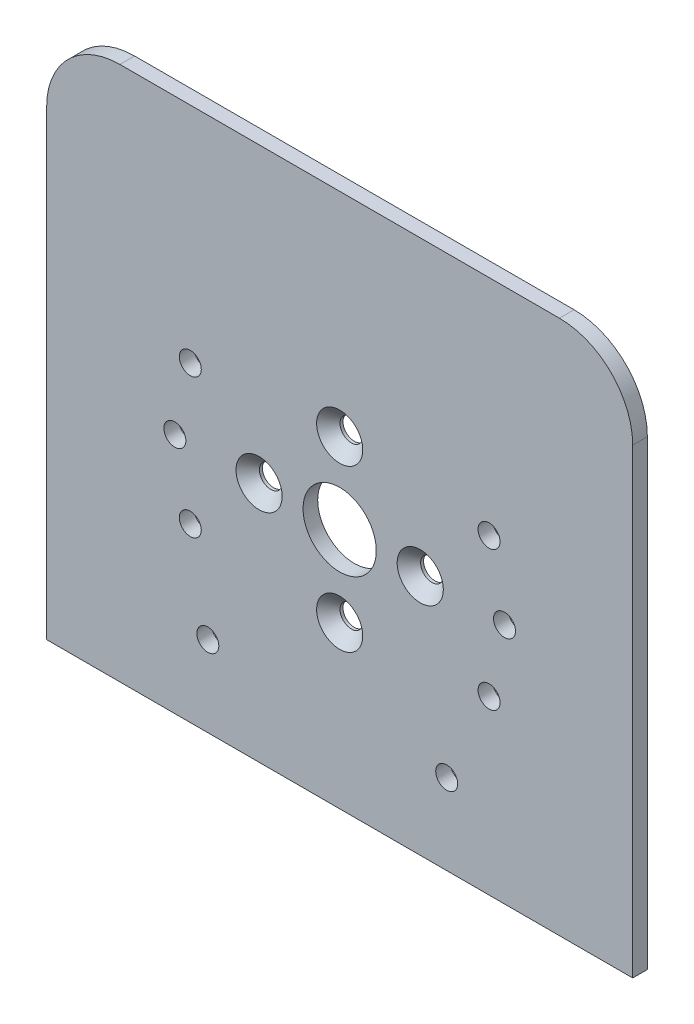
ISO-10303-21;
HEADER;
FILE_DESCRIPTION(('STEP AP214'),'2;1');
FILE_NAME('part.step','',(''),(''),'','','');
FILE_SCHEMA(('AUTOMOTIVE_DESIGN { 1 0 10303 214 1 1 1 1 }'));
ENDSEC;
DATA;
#1=APPLICATION_CONTEXT('core data for automotive mechanical design processes');
#2=APPLICATION_PROTOCOL_DEFINITION('international standard','automotive_design',2000,#1);
#3=PRODUCT_CONTEXT('',#1,'mechanical');
#4=PRODUCT('Part','Part','',(#3));
#5=PRODUCT_RELATED_PRODUCT_CATEGORY('part','',(#4));
#6=PRODUCT_DEFINITION_FORMATION('','',#4);
#7=PRODUCT_DEFINITION_CONTEXT('part definition',#1,'design');
#8=PRODUCT_DEFINITION('design','',#6,#7);
#9=PRODUCT_DEFINITION_SHAPE('','',#8);
#10=(LENGTH_UNIT() NAMED_UNIT(*) SI_UNIT(.MILLI.,.METRE.));
#11=(NAMED_UNIT(*) PLANE_ANGLE_UNIT() SI_UNIT($,.RADIAN.));
#12=(NAMED_UNIT(*) SI_UNIT($,.STERADIAN.) SOLID_ANGLE_UNIT());
#13=UNCERTAINTY_MEASURE_WITH_UNIT(LENGTH_MEASURE(1.E-05),#10,'distance_accuracy_value','');
#14=(GEOMETRIC_REPRESENTATION_CONTEXT(3) GLOBAL_UNCERTAINTY_ASSIGNED_CONTEXT((#13)) GLOBAL_UNIT_ASSIGNED_CONTEXT((#10,
#11,#12)) REPRESENTATION_CONTEXT('',''));
#15=CARTESIAN_POINT('',(0.,0.,0.));
#16=DIRECTION('',(0.,0.,1.));
#17=DIRECTION('',(1.,0.,0.));
#18=AXIS2_PLACEMENT_3D('',#15,#16,#17);
#19=CARTESIAN_POINT('',(0.,0.,-3.3));
#20=DIRECTION('',(0.,0.,1.));
#21=DIRECTION('',(1.,0.,0.));
#22=AXIS2_PLACEMENT_3D('',#19,#20,#21);
#23=PLANE('',#22);
#24=CARTESIAN_POINT('',(-20.3919252083246,-9.50891088916577,-3.3));
#25=DIRECTION('',(0.,0.,1.));
#26=DIRECTION('',(1.,0.,0.));
#27=AXIS2_PLACEMENT_3D('',#24,#25,#26);
#28=CIRCLE('',#27,1.5);
#29=CARTESIAN_POINT('',(-18.8919252083246,-9.50891088916577,-3.3));
#30=VERTEX_POINT('',#29);
#31=EDGE_CURVE('E229',#30,#30,#28,.T.);
#32=ORIENTED_EDGE('',*,*,#31,.T.);
#33=EDGE_LOOP('',(#32));
#34=FACE_BOUND('',#33,.T.);
#35=CARTESIAN_POINT('',(-22.5,0.,-3.3));
#36=DIRECTION('',(0.,0.,1.));
#37=DIRECTION('',(1.,0.,0.));
#38=AXIS2_PLACEMENT_3D('',#35,#36,#37);
#39=CIRCLE('',#38,1.5);
#40=CARTESIAN_POINT('',(-21.,0.,-3.3));
#41=VERTEX_POINT('',#40);
#42=EDGE_CURVE('E223',#41,#41,#39,.T.);
#43=ORIENTED_EDGE('',*,*,#42,.T.);
#44=EDGE_LOOP('',(#43));
#45=FACE_BOUND('',#44,.T.);
#46=CARTESIAN_POINT('',(-20.3919252083246,9.50891088916577,-3.3));
#47=DIRECTION('',(0.,0.,1.));
#48=DIRECTION('',(1.,0.,0.));
#49=AXIS2_PLACEMENT_3D('',#46,#47,#48);
#50=CIRCLE('',#49,1.5);
#51=CARTESIAN_POINT('',(-18.8919252083246,9.50891088916577,-3.3));
#52=VERTEX_POINT('',#51);
#53=EDGE_CURVE('E217',#52,#52,#50,.T.);
#54=ORIENTED_EDGE('',*,*,#53,.T.);
#55=EDGE_LOOP('',(#54));
#56=FACE_BOUND('',#55,.T.);
#57=CARTESIAN_POINT('',(20.3919252083246,-9.50891088916577,-3.3));
#58=DIRECTION('',(0.,0.,1.));
#59=DIRECTION('',(1.,0.,0.));
#60=AXIS2_PLACEMENT_3D('',#57,#58,#59);
#61=CIRCLE('',#60,1.5);
#62=CARTESIAN_POINT('',(21.8919252083246,-9.50891088916577,-3.3));
#63=VERTEX_POINT('',#62);
#64=EDGE_CURVE('E211',#63,#63,#61,.T.);
#65=ORIENTED_EDGE('',*,*,#64,.T.);
#66=EDGE_LOOP('',(#65));
#67=FACE_BOUND('',#66,.T.);
#68=CARTESIAN_POINT('',(22.5,0.,-3.3));
#69=DIRECTION('',(0.,0.,1.));
#70=DIRECTION('',(1.,0.,0.));
#71=AXIS2_PLACEMENT_3D('',#68,#69,#70);
#72=CIRCLE('',#71,1.5);
#73=CARTESIAN_POINT('',(24.,0.,-3.3));
#74=VERTEX_POINT('',#73);
#75=EDGE_CURVE('E205',#74,#74,#72,.T.);
#76=ORIENTED_EDGE('',*,*,#75,.T.);
#77=EDGE_LOOP('',(#76));
#78=FACE_BOUND('',#77,.T.);
#79=CARTESIAN_POINT('',(20.3919252083246,9.50891088916577,-3.3));
#80=DIRECTION('',(0.,0.,1.));
#81=DIRECTION('',(1.,0.,0.));
#82=AXIS2_PLACEMENT_3D('',#79,#80,#81);
#83=CIRCLE('',#82,1.5);
#84=CARTESIAN_POINT('',(21.8919252083246,9.50891088916577,-3.3));
#85=VERTEX_POINT('',#84);
#86=EDGE_CURVE('E199',#85,#85,#83,.T.);
#87=ORIENTED_EDGE('',*,*,#86,.T.);
#88=EDGE_LOOP('',(#87));
#89=FACE_BOUND('',#88,.T.);
#90=CARTESIAN_POINT('',(14.60943136,-22.,-3.3));
#91=DIRECTION('',(0.,0.,-1.));
#92=DIRECTION('',(-1.,0.,0.));
#93=AXIS2_PLACEMENT_3D('',#90,#91,#92);
#94=CIRCLE('',#93,1.49999999999999);
#95=CARTESIAN_POINT('',(13.10943136,-22.,-3.3));
#96=VERTEX_POINT('',#95);
#97=EDGE_CURVE('E196',#96,#96,#94,.T.);
#98=ORIENTED_EDGE('',*,*,#97,.F.);
#99=EDGE_LOOP('',(#98));
#100=FACE_BOUND('',#99,.T.);
#101=CARTESIAN_POINT('',(-18.,-22.,-3.3));
#102=DIRECTION('',(0.,0.,-1.));
#103=DIRECTION('',(-1.,0.,0.));
#104=AXIS2_PLACEMENT_3D('',#101,#102,#103);
#105=CIRCLE('',#104,1.49999999999999);
#106=CARTESIAN_POINT('',(-19.5,-22.,-3.3));
#107=VERTEX_POINT('',#106);
#108=EDGE_CURVE('E190',#107,#107,#105,.T.);
#109=ORIENTED_EDGE('',*,*,#108,.F.);
#110=EDGE_LOOP('',(#109));
#111=FACE_BOUND('',#110,.T.);
#112=CARTESIAN_POINT('',(-11.,0.,-3.3));
#113=DIRECTION('',(0.,0.,1.));
#114=DIRECTION('',(-1.,0.,0.));
#115=AXIS2_PLACEMENT_3D('',#112,#113,#114);
#116=CIRCLE('',#115,1.55);
#117=CARTESIAN_POINT('',(-12.55,0.,-3.3));
#118=VERTEX_POINT('',#117);
#119=EDGE_CURVE('E183',#118,#118,#116,.T.);
#120=ORIENTED_EDGE('',*,*,#119,.T.);
#121=EDGE_LOOP('',(#120));
#122=FACE_BOUND('',#121,.T.);
#123=CARTESIAN_POINT('',(1.15218884181823E-13,11.,-3.3));
#124=DIRECTION('',(0.,0.,1.));
#125=DIRECTION('',(0.,1.,0.));
#126=AXIS2_PLACEMENT_3D('',#123,#124,#125);
#127=CIRCLE('',#126,1.55);
#128=CARTESIAN_POINT('',(1.31454272407444E-13,12.55,-3.3));
#129=VERTEX_POINT('',#128);
#130=EDGE_CURVE('E174',#129,#129,#127,.T.);
#131=ORIENTED_EDGE('',*,*,#130,.T.);
#132=EDGE_LOOP('',(#131));
#133=FACE_BOUND('',#132,.T.);
#134=CARTESIAN_POINT('',(0.,-11.,-3.3));
#135=DIRECTION('',(0.,0.,1.));
#136=DIRECTION('',(0.,-1.,0.));
#137=AXIS2_PLACEMENT_3D('',#134,#135,#136);
#138=CIRCLE('',#137,1.55);
#139=CARTESIAN_POINT('',(0.,-12.55,-3.3));
#140=VERTEX_POINT('',#139);
#141=EDGE_CURVE('E163',#140,#140,#138,.T.);
#142=ORIENTED_EDGE('',*,*,#141,.T.);
#143=EDGE_LOOP('',(#142));
#144=FACE_BOUND('',#143,.T.);
#145=CARTESIAN_POINT('',(11.,0.,-3.3));
#146=DIRECTION('',(0.,0.,1.));
#147=DIRECTION('',(1.,0.,0.));
#148=AXIS2_PLACEMENT_3D('',#145,#146,#147);
#149=CIRCLE('',#148,1.55);
#150=CARTESIAN_POINT('',(12.55,0.,-3.3));
#151=VERTEX_POINT('',#150);
#152=EDGE_CURVE('E124',#151,#151,#149,.T.);
#153=ORIENTED_EDGE('',*,*,#152,.T.);
#154=EDGE_LOOP('',(#153));
#155=FACE_BOUND('',#154,.T.);
#156=DIRECTION('',(1.,0.,0.));
#157=VECTOR('',#156,1.);
#158=CARTESIAN_POINT('',(-40.,40.,-3.3));
#159=LINE('',#158,#157);
#160=CARTESIAN_POINT('',(-30.,40.,-3.3));
#161=VERTEX_POINT('',#160);
#162=CARTESIAN_POINT('',(30.,40.,-3.3));
#163=VERTEX_POINT('',#162);
#164=EDGE_CURVE('E97',#161,#163,#159,.T.);
#165=ORIENTED_EDGE('',*,*,#164,.T.);
#166=CARTESIAN_POINT('',(30.,30.,-3.3));
#167=DIRECTION('',(0.,0.,1.));
#168=DIRECTION('',(1.,0.,0.));
#169=AXIS2_PLACEMENT_3D('',#166,#167,#168);
#170=CIRCLE('',#169,10.);
#171=CARTESIAN_POINT('',(40.,30.,-3.3));
#172=VERTEX_POINT('',#171);
#173=EDGE_CURVE('E41',#163,#172,#170,.F.);
#174=ORIENTED_EDGE('',*,*,#173,.T.);
#175=DIRECTION('',(0.,-1.,0.));
#176=VECTOR('',#175,1.);
#177=CARTESIAN_POINT('',(40.,40.,-3.3));
#178=LINE('',#177,#176);
#179=CARTESIAN_POINT('',(40.,-33.,-3.3));
#180=VERTEX_POINT('',#179);
#181=EDGE_CURVE('E87',#172,#180,#178,.T.);
#182=ORIENTED_EDGE('',*,*,#181,.T.);
#183=DIRECTION('',(-1.,0.,0.));
#184=VECTOR('',#183,1.);
#185=CARTESIAN_POINT('',(-40.,-33.,-3.3));
#186=LINE('',#185,#184);
#187=CARTESIAN_POINT('',(-40.,-33.,-3.3));
#188=VERTEX_POINT('',#187);
#189=EDGE_CURVE('E91',#180,#188,#186,.T.);
#190=ORIENTED_EDGE('',*,*,#189,.T.);
#191=DIRECTION('',(0.,1.,0.));
#192=VECTOR('',#191,1.);
#193=CARTESIAN_POINT('',(-40.,40.,-3.3));
#194=LINE('',#193,#192);
#195=CARTESIAN_POINT('',(-40.,30.,-3.3));
#196=VERTEX_POINT('',#195);
#197=EDGE_CURVE('E122',#188,#196,#194,.T.);
#198=ORIENTED_EDGE('',*,*,#197,.T.);
#199=CARTESIAN_POINT('',(-30.,30.,-3.3));
#200=DIRECTION('',(0.,0.,1.));
#201=DIRECTION('',(1.,0.,0.));
#202=AXIS2_PLACEMENT_3D('',#199,#200,#201);
#203=CIRCLE('',#202,10.);
#204=EDGE_CURVE('E138',#196,#161,#203,.F.);
#205=ORIENTED_EDGE('',*,*,#204,.T.);
#206=EDGE_LOOP('',(#165,#174,#182,#190,#198,#205));
#207=FACE_BOUND('',#206,.T.);
#208=CARTESIAN_POINT('',(0.,0.,-3.3));
#209=DIRECTION('',(0.,0.,-1.));
#210=DIRECTION('',(-1.,0.,0.));
#211=AXIS2_PLACEMENT_3D('',#208,#209,#210);
#212=CIRCLE('',#211,5.);
#213=CARTESIAN_POINT('',(-5.,0.,-3.3));
#214=VERTEX_POINT('',#213);
#215=EDGE_CURVE('E118',#214,#214,#212,.T.);
#216=ORIENTED_EDGE('',*,*,#215,.F.);
#217=EDGE_LOOP('',(#216));
#218=FACE_BOUND('',#217,.T.);
#219=ADVANCED_FACE('F33',(#34,#45,#56,#67,#78,#89,#100,#111,#122,#133,#144,#155,#207,#218),#23,.F.);
#220=CARTESIAN_POINT('',(0.,0.,-1.3));
#221=DIRECTION('',(0.,0.,1.));
#222=DIRECTION('',(1.,0.,0.));
#223=AXIS2_PLACEMENT_3D('',#220,#221,#222);
#224=PLANE('',#223);
#225=CARTESIAN_POINT('',(-20.3919252083246,-9.50891088916577,-1.3));
#226=DIRECTION('',(0.,0.,1.));
#227=DIRECTION('',(1.,0.,0.));
#228=AXIS2_PLACEMENT_3D('',#225,#226,#227);
#229=CIRCLE('',#228,1.49999999999999);
#230=CARTESIAN_POINT('',(-18.8919252083246,-9.50891088916577,-1.3));
#231=VERTEX_POINT('',#230);
#232=EDGE_CURVE('E232',#231,#231,#229,.T.);
#233=ORIENTED_EDGE('',*,*,#232,.F.);
#234=EDGE_LOOP('',(#233));
#235=FACE_BOUND('',#234,.T.);
#236=CARTESIAN_POINT('',(-22.5,0.,-1.3));
#237=DIRECTION('',(0.,0.,1.));
#238=DIRECTION('',(1.,0.,0.));
#239=AXIS2_PLACEMENT_3D('',#236,#237,#238);
#240=CIRCLE('',#239,1.49999999999999);
#241=CARTESIAN_POINT('',(-21.,0.,-1.3));
#242=VERTEX_POINT('',#241);
#243=EDGE_CURVE('E226',#242,#242,#240,.T.);
#244=ORIENTED_EDGE('',*,*,#243,.F.);
#245=EDGE_LOOP('',(#244));
#246=FACE_BOUND('',#245,.T.);
#247=CARTESIAN_POINT('',(-20.3919252083246,9.50891088916577,-1.3));
#248=DIRECTION('',(0.,0.,1.));
#249=DIRECTION('',(1.,0.,0.));
#250=AXIS2_PLACEMENT_3D('',#247,#248,#249);
#251=CIRCLE('',#250,1.49999999999999);
#252=CARTESIAN_POINT('',(-18.8919252083246,9.50891088916577,-1.3));
#253=VERTEX_POINT('',#252);
#254=EDGE_CURVE('E220',#253,#253,#251,.T.);
#255=ORIENTED_EDGE('',*,*,#254,.F.);
#256=EDGE_LOOP('',(#255));
#257=FACE_BOUND('',#256,.T.);
#258=CARTESIAN_POINT('',(20.3919252083246,-9.50891088916577,-1.3));
#259=DIRECTION('',(0.,0.,1.));
#260=DIRECTION('',(1.,0.,0.));
#261=AXIS2_PLACEMENT_3D('',#258,#259,#260);
#262=CIRCLE('',#261,1.49999999999999);
#263=CARTESIAN_POINT('',(21.8919252083246,-9.50891088916577,-1.3));
#264=VERTEX_POINT('',#263);
#265=EDGE_CURVE('E214',#264,#264,#262,.T.);
#266=ORIENTED_EDGE('',*,*,#265,.F.);
#267=EDGE_LOOP('',(#266));
#268=FACE_BOUND('',#267,.T.);
#269=CARTESIAN_POINT('',(22.5,0.,-1.3));
#270=DIRECTION('',(0.,0.,1.));
#271=DIRECTION('',(1.,0.,0.));
#272=AXIS2_PLACEMENT_3D('',#269,#270,#271);
#273=CIRCLE('',#272,1.49999999999999);
#274=CARTESIAN_POINT('',(24.,0.,-1.3));
#275=VERTEX_POINT('',#274);
#276=EDGE_CURVE('E208',#275,#275,#273,.T.);
#277=ORIENTED_EDGE('',*,*,#276,.F.);
#278=EDGE_LOOP('',(#277));
#279=FACE_BOUND('',#278,.T.);
#280=CARTESIAN_POINT('',(20.3919252083246,9.50891088916577,-1.3));
#281=DIRECTION('',(0.,0.,1.));
#282=DIRECTION('',(1.,0.,0.));
#283=AXIS2_PLACEMENT_3D('',#280,#281,#282);
#284=CIRCLE('',#283,1.49999999999999);
#285=CARTESIAN_POINT('',(21.8919252083246,9.50891088916577,-1.3));
#286=VERTEX_POINT('',#285);
#287=EDGE_CURVE('E202',#286,#286,#284,.T.);
#288=ORIENTED_EDGE('',*,*,#287,.F.);
#289=EDGE_LOOP('',(#288));
#290=FACE_BOUND('',#289,.T.);
#291=CARTESIAN_POINT('',(14.60943136,-22.,-1.3));
#292=DIRECTION('',(0.,0.,-1.));
#293=DIRECTION('',(-1.,0.,0.));
#294=AXIS2_PLACEMENT_3D('',#291,#292,#293);
#295=CIRCLE('',#294,1.5);
#296=CARTESIAN_POINT('',(13.10943136,-22.,-1.3));
#297=VERTEX_POINT('',#296);
#298=EDGE_CURVE('E193',#297,#297,#295,.T.);
#299=ORIENTED_EDGE('',*,*,#298,.T.);
#300=EDGE_LOOP('',(#299));
#301=FACE_BOUND('',#300,.T.);
#302=CARTESIAN_POINT('',(-18.,-22.,-1.3));
#303=DIRECTION('',(0.,0.,-1.));
#304=DIRECTION('',(-1.,0.,0.));
#305=AXIS2_PLACEMENT_3D('',#302,#303,#304);
#306=CIRCLE('',#305,1.5);
#307=CARTESIAN_POINT('',(-19.5,-22.,-1.3));
#308=VERTEX_POINT('',#307);
#309=EDGE_CURVE('E180',#308,#308,#306,.T.);
#310=ORIENTED_EDGE('',*,*,#309,.T.);
#311=EDGE_LOOP('',(#310));
#312=FACE_BOUND('',#311,.T.);
#313=CARTESIAN_POINT('',(-11.,0.,-1.3));
#314=DIRECTION('',(0.,0.,1.));
#315=DIRECTION('',(-1.,0.,0.));
#316=AXIS2_PLACEMENT_3D('',#313,#314,#315);
#317=CIRCLE('',#316,3.15);
#318=CARTESIAN_POINT('',(-14.15,0.,-1.3));
#319=VERTEX_POINT('',#318);
#320=EDGE_CURVE('E173',#319,#319,#317,.T.);
#321=ORIENTED_EDGE('',*,*,#320,.F.);
#322=EDGE_LOOP('',(#321));
#323=FACE_BOUND('',#322,.T.);
#324=CARTESIAN_POINT('',(1.15218884181823E-13,11.,-1.3));
#325=DIRECTION('',(0.,0.,1.));
#326=DIRECTION('',(0.,1.,0.));
#327=AXIS2_PLACEMENT_3D('',#324,#325,#326);
#328=CIRCLE('',#327,3.15);
#329=CARTESIAN_POINT('',(1.48213382833891E-13,14.15,-1.3));
#330=VERTEX_POINT('',#329);
#331=EDGE_CURVE('E177',#330,#330,#328,.T.);
#332=ORIENTED_EDGE('',*,*,#331,.F.);
#333=EDGE_LOOP('',(#332));
#334=FACE_BOUND('',#333,.T.);
#335=CARTESIAN_POINT('',(0.,-11.,-1.3));
#336=DIRECTION('',(0.,0.,1.));
#337=DIRECTION('',(0.,-1.,0.));
#338=AXIS2_PLACEMENT_3D('',#335,#336,#337);
#339=CIRCLE('',#338,3.15);
#340=CARTESIAN_POINT('',(0.,-14.15,-1.3));
#341=VERTEX_POINT('',#340);
#342=EDGE_CURVE('E166',#341,#341,#339,.T.);
#343=ORIENTED_EDGE('',*,*,#342,.F.);
#344=EDGE_LOOP('',(#343));
#345=FACE_BOUND('',#344,.T.);
#346=CARTESIAN_POINT('',(11.,0.,-1.3));
#347=DIRECTION('',(0.,0.,1.));
#348=DIRECTION('',(1.,0.,0.));
#349=AXIS2_PLACEMENT_3D('',#346,#347,#348);
#350=CIRCLE('',#349,3.15);
#351=CARTESIAN_POINT('',(14.15,0.,-1.3));
#352=VERTEX_POINT('',#351);
#353=EDGE_CURVE('E157',#352,#352,#350,.T.);
#354=ORIENTED_EDGE('',*,*,#353,.F.);
#355=EDGE_LOOP('',(#354));
#356=FACE_BOUND('',#355,.T.);
#357=DIRECTION('',(0.,-1.,0.));
#358=VECTOR('',#357,1.);
#359=CARTESIAN_POINT('',(40.,40.,-1.3));
#360=LINE('',#359,#358);
#361=CARTESIAN_POINT('',(40.,30.,-1.3));
#362=VERTEX_POINT('',#361);
#363=CARTESIAN_POINT('',(40.,-33.,-1.3));
#364=VERTEX_POINT('',#363);
#365=EDGE_CURVE('E103',#362,#364,#360,.T.);
#366=ORIENTED_EDGE('',*,*,#365,.F.);
#367=CARTESIAN_POINT('',(30.,30.,-1.3));
#368=DIRECTION('',(0.,0.,1.));
#369=DIRECTION('',(1.,0.,0.));
#370=AXIS2_PLACEMENT_3D('',#367,#368,#369);
#371=CIRCLE('',#370,10.);
#372=CARTESIAN_POINT('',(30.,40.,-1.3));
#373=VERTEX_POINT('',#372);
#374=EDGE_CURVE('E132',#362,#373,#371,.T.);
#375=ORIENTED_EDGE('',*,*,#374,.T.);
#376=DIRECTION('',(1.,0.,0.));
#377=VECTOR('',#376,1.);
#378=CARTESIAN_POINT('',(-40.,40.,-1.3));
#379=LINE('',#378,#377);
#380=CARTESIAN_POINT('',(-30.,40.,-1.3));
#381=VERTEX_POINT('',#380);
#382=EDGE_CURVE('E117',#381,#373,#379,.T.);
#383=ORIENTED_EDGE('',*,*,#382,.F.);
#384=CARTESIAN_POINT('',(-30.,30.,-1.3));
#385=DIRECTION('',(0.,0.,1.));
#386=DIRECTION('',(1.,0.,0.));
#387=AXIS2_PLACEMENT_3D('',#384,#385,#386);
#388=CIRCLE('',#387,10.);
#389=CARTESIAN_POINT('',(-40.,30.,-1.3));
#390=VERTEX_POINT('',#389);
#391=EDGE_CURVE('E130',#381,#390,#388,.T.);
#392=ORIENTED_EDGE('',*,*,#391,.T.);
#393=DIRECTION('',(0.,1.,0.));
#394=VECTOR('',#393,1.);
#395=CARTESIAN_POINT('',(-40.,40.,-1.3));
#396=LINE('',#395,#394);
#397=CARTESIAN_POINT('',(-40.,-33.,-1.3));
#398=VERTEX_POINT('',#397);
#399=EDGE_CURVE('E115',#398,#390,#396,.T.);
#400=ORIENTED_EDGE('',*,*,#399,.F.);
#401=DIRECTION('',(-1.,0.,0.));
#402=VECTOR('',#401,1.);
#403=CARTESIAN_POINT('',(-40.,-33.,-1.3));
#404=LINE('',#403,#402);
#405=EDGE_CURVE('E121',#364,#398,#404,.T.);
#406=ORIENTED_EDGE('',*,*,#405,.F.);
#407=EDGE_LOOP('',(#366,#375,#383,#392,#400,#406));
#408=FACE_BOUND('',#407,.T.);
#409=CARTESIAN_POINT('',(0.,0.,-1.3));
#410=DIRECTION('',(0.,0.,-1.));
#411=DIRECTION('',(-1.,0.,0.));
#412=AXIS2_PLACEMENT_3D('',#409,#410,#411);
#413=CIRCLE('',#412,5.);
#414=CARTESIAN_POINT('',(-5.,0.,-1.3));
#415=VERTEX_POINT('',#414);
#416=EDGE_CURVE('E127',#415,#415,#413,.T.);
#417=ORIENTED_EDGE('',*,*,#416,.T.);
#418=EDGE_LOOP('',(#417));
#419=FACE_BOUND('',#418,.T.);
#420=ADVANCED_FACE('F146',(#235,#246,#257,#268,#279,#290,#301,#312,#323,#334,#345,#356,#408,
#419),#224,.T.);
#421=CARTESIAN_POINT('',(-40.,40.,-3.3));
#422=DIRECTION('',(1.,0.,0.));
#423=DIRECTION('',(0.,0.,-1.));
#424=AXIS2_PLACEMENT_3D('',#421,#422,#423);
#425=PLANE('',#424);
#426=ORIENTED_EDGE('',*,*,#399,.T.);
#427=DIRECTION('',(0.,0.,1.));
#428=VECTOR('',#427,1.);
#429=CARTESIAN_POINT('',(-40.,30.,-3.3));
#430=LINE('',#429,#428);
#431=EDGE_CURVE('E11',#390,#196,#430,.F.);
#432=ORIENTED_EDGE('',*,*,#431,.T.);
#433=ORIENTED_EDGE('',*,*,#197,.F.);
#434=DIRECTION('',(0.,0.,1.));
#435=VECTOR('',#434,1.);
#436=CARTESIAN_POINT('',(-40.,-33.,-3.3));
#437=LINE('',#436,#435);
#438=EDGE_CURVE('E107',#188,#398,#437,.T.);
#439=ORIENTED_EDGE('',*,*,#438,.T.);
#440=EDGE_LOOP('',(#426,#432,#433,#439));
#441=FACE_BOUND('',#440,.T.);
#442=ADVANCED_FACE('F148',(#441),#425,.F.);
#443=CARTESIAN_POINT('',(-40.,40.,-3.3));
#444=DIRECTION('',(0.,-1.,0.));
#445=DIRECTION('',(1.,0.,0.));
#446=AXIS2_PLACEMENT_3D('',#443,#444,#445);
#447=PLANE('',#446);
#448=ORIENTED_EDGE('',*,*,#382,.T.);
#449=DIRECTION('',(0.,0.,1.));
#450=VECTOR('',#449,1.);
#451=CARTESIAN_POINT('',(30.,40.,-3.3));
#452=LINE('',#451,#450);
#453=EDGE_CURVE('E54',#373,#163,#452,.F.);
#454=ORIENTED_EDGE('',*,*,#453,.T.);
#455=ORIENTED_EDGE('',*,*,#164,.F.);
#456=DIRECTION('',(0.,0.,1.));
#457=VECTOR('',#456,1.);
#458=CARTESIAN_POINT('',(-30.,40.,-3.3));
#459=LINE('',#458,#457);
#460=EDGE_CURVE('E134',#161,#381,#459,.T.);
#461=ORIENTED_EDGE('',*,*,#460,.T.);
#462=EDGE_LOOP('',(#448,#454,#455,#461));
#463=FACE_BOUND('',#462,.T.);
#464=ADVANCED_FACE('F142',(#463),#447,.F.);
#465=CARTESIAN_POINT('',(40.,40.,-3.3));
#466=DIRECTION('',(-1.,0.,0.));
#467=DIRECTION('',(0.,-1.,0.));
#468=AXIS2_PLACEMENT_3D('',#465,#466,#467);
#469=PLANE('',#468);
#470=ORIENTED_EDGE('',*,*,#181,.F.);
#471=DIRECTION('',(0.,0.,1.));
#472=VECTOR('',#471,1.);
#473=CARTESIAN_POINT('',(40.,30.,-3.3));
#474=LINE('',#473,#472);
#475=EDGE_CURVE('E106',#172,#362,#474,.T.);
#476=ORIENTED_EDGE('',*,*,#475,.T.);
#477=ORIENTED_EDGE('',*,*,#365,.T.);
#478=DIRECTION('',(0.,0.,1.));
#479=VECTOR('',#478,1.);
#480=CARTESIAN_POINT('',(40.,-33.,-3.3));
#481=LINE('',#480,#479);
#482=EDGE_CURVE('E100',#180,#364,#481,.T.);
#483=ORIENTED_EDGE('',*,*,#482,.F.);
#484=EDGE_LOOP('',(#470,#476,#477,#483));
#485=FACE_BOUND('',#484,.T.);
#486=ADVANCED_FACE('F101',(#485),#469,.F.);
#487=CARTESIAN_POINT('',(-40.,-33.,-3.3));
#488=DIRECTION('',(0.,1.,0.));
#489=DIRECTION('',(-1.,0.,0.));
#490=AXIS2_PLACEMENT_3D('',#487,#488,#489);
#491=PLANE('',#490);
#492=ORIENTED_EDGE('',*,*,#405,.T.);
#493=ORIENTED_EDGE('',*,*,#438,.F.);
#494=ORIENTED_EDGE('',*,*,#189,.F.);
#495=ORIENTED_EDGE('',*,*,#482,.T.);
#496=EDGE_LOOP('',(#492,#493,#494,#495));
#497=FACE_BOUND('',#496,.T.);
#498=ADVANCED_FACE('F109',(#497),#491,.F.);
#499=CARTESIAN_POINT('',(0.,0.,-3.3));
#500=DIRECTION('',(0.,0.,1.));
#501=DIRECTION('',(1.,0.,0.));
#502=AXIS2_PLACEMENT_3D('',#499,#500,#501);
#503=CYLINDRICAL_SURFACE('',#502,5.);
#504=ORIENTED_EDGE('',*,*,#215,.T.);
#505=EDGE_LOOP('',(#504));
#506=FACE_BOUND('',#505,.T.);
#507=ORIENTED_EDGE('',*,*,#416,.F.);
#508=EDGE_LOOP('',(#507));
#509=FACE_BOUND('',#508,.T.);
#510=ADVANCED_FACE('F276',(#506,#509),#503,.F.);
#511=CARTESIAN_POINT('',(11.,0.,-1.3));
#512=DIRECTION('',(0.,0.,1.));
#513=DIRECTION('',(1.,0.,0.));
#514=AXIS2_PLACEMENT_3D('',#511,#512,#513);
#515=CYLINDRICAL_SURFACE('',#514,1.55);
#516=CARTESIAN_POINT('',(11.,0.,-2.9));
#517=DIRECTION('',(0.,0.,1.));
#518=DIRECTION('',(1.,0.,0.));
#519=AXIS2_PLACEMENT_3D('',#516,#517,#518);
#520=CIRCLE('',#519,1.55);
#521=CARTESIAN_POINT('',(12.55,0.,-2.9));
#522=VERTEX_POINT('',#521);
#523=EDGE_CURVE('E128',#522,#522,#520,.T.);
#524=ORIENTED_EDGE('',*,*,#523,.T.);
#525=EDGE_LOOP('',(#524));
#526=FACE_BOUND('',#525,.T.);
#527=ORIENTED_EDGE('',*,*,#152,.F.);
#528=EDGE_LOOP('',(#527));
#529=FACE_BOUND('',#528,.T.);
#530=ADVANCED_FACE('F266',(#526,#529),#515,.F.);
#531=CARTESIAN_POINT('',(11.,0.,-1.3));
#532=DIRECTION('',(0.,0.,1.));
#533=DIRECTION('',(1.,0.,0.));
#534=AXIS2_PLACEMENT_3D('',#531,#532,#533);
#535=CONICAL_SURFACE('',#534,3.15,0.785398163397448);
#536=ORIENTED_EDGE('',*,*,#523,.F.);
#537=EDGE_LOOP('',(#536));
#538=FACE_BOUND('',#537,.T.);
#539=ORIENTED_EDGE('',*,*,#353,.T.);
#540=EDGE_LOOP('',(#539));
#541=FACE_BOUND('',#540,.T.);
#542=ADVANCED_FACE('F263',(#538,#541),#535,.F.);
#543=CARTESIAN_POINT('',(0.,-11.,-1.3));
#544=DIRECTION('',(0.,0.,1.));
#545=DIRECTION('',(0.,-1.,0.));
#546=AXIS2_PLACEMENT_3D('',#543,#544,#545);
#547=CYLINDRICAL_SURFACE('',#546,1.55);
#548=CARTESIAN_POINT('',(0.,-11.,-2.9));
#549=DIRECTION('',(0.,0.,1.));
#550=DIRECTION('',(0.,-1.,0.));
#551=AXIS2_PLACEMENT_3D('',#548,#549,#550);
#552=CIRCLE('',#551,1.55);
#553=CARTESIAN_POINT('',(0.,-12.55,-2.9));
#554=VERTEX_POINT('',#553);
#555=EDGE_CURVE('E160',#554,#554,#552,.T.);
#556=ORIENTED_EDGE('',*,*,#555,.T.);
#557=EDGE_LOOP('',(#556));
#558=FACE_BOUND('',#557,.T.);
#559=ORIENTED_EDGE('',*,*,#141,.F.);
#560=EDGE_LOOP('',(#559));
#561=FACE_BOUND('',#560,.T.);
#562=ADVANCED_FACE('F265',(#558,#561),#547,.F.);
#563=CARTESIAN_POINT('',(0.,-11.,-1.3));
#564=DIRECTION('',(0.,0.,1.));
#565=DIRECTION('',(0.,-1.,0.));
#566=AXIS2_PLACEMENT_3D('',#563,#564,#565);
#567=CONICAL_SURFACE('',#566,3.15,0.785398163397448);
#568=ORIENTED_EDGE('',*,*,#555,.F.);
#569=EDGE_LOOP('',(#568));
#570=FACE_BOUND('',#569,.T.);
#571=ORIENTED_EDGE('',*,*,#342,.T.);
#572=EDGE_LOOP('',(#571));
#573=FACE_BOUND('',#572,.T.);
#574=ADVANCED_FACE('F273',(#570,#573),#567,.F.);
#575=CARTESIAN_POINT('',(1.15218884181823E-13,11.,-1.3));
#576=DIRECTION('',(0.,0.,1.));
#577=DIRECTION('',(0.,1.,0.));
#578=AXIS2_PLACEMENT_3D('',#575,#576,#577);
#579=CYLINDRICAL_SURFACE('',#578,1.55);
#580=CARTESIAN_POINT('',(1.15218884181823E-13,11.,-2.9));
#581=DIRECTION('',(0.,0.,1.));
#582=DIRECTION('',(0.,1.,0.));
#583=AXIS2_PLACEMENT_3D('',#580,#581,#582);
#584=CIRCLE('',#583,1.55);
#585=CARTESIAN_POINT('',(1.31454272407444E-13,12.55,-2.9));
#586=VERTEX_POINT('',#585);
#587=EDGE_CURVE('E170',#586,#586,#584,.T.);
#588=ORIENTED_EDGE('',*,*,#587,.T.);
#589=EDGE_LOOP('',(#588));
#590=FACE_BOUND('',#589,.T.);
#591=ORIENTED_EDGE('',*,*,#130,.F.);
#592=EDGE_LOOP('',(#591));
#593=FACE_BOUND('',#592,.T.);
#594=ADVANCED_FACE('F321',(#590,#593),#579,.F.);
#595=CARTESIAN_POINT('',(1.15218884181823E-13,11.,-1.3));
#596=DIRECTION('',(0.,0.,1.));
#597=DIRECTION('',(0.,1.,0.));
#598=AXIS2_PLACEMENT_3D('',#595,#596,#597);
#599=CONICAL_SURFACE('',#598,3.15,0.785398163397448);
#600=ORIENTED_EDGE('',*,*,#587,.F.);
#601=EDGE_LOOP('',(#600));
#602=FACE_BOUND('',#601,.T.);
#603=ORIENTED_EDGE('',*,*,#331,.T.);
#604=EDGE_LOOP('',(#603));
#605=FACE_BOUND('',#604,.T.);
#606=ADVANCED_FACE('F311',(#602,#605),#599,.F.);
#607=CARTESIAN_POINT('',(-11.,0.,-1.3));
#608=DIRECTION('',(0.,0.,1.));
#609=DIRECTION('',(-1.,0.,0.));
#610=AXIS2_PLACEMENT_3D('',#607,#608,#609);
#611=CYLINDRICAL_SURFACE('',#610,1.55);
#612=CARTESIAN_POINT('',(-11.,0.,-2.9));
#613=DIRECTION('',(0.,0.,1.));
#614=DIRECTION('',(-1.,0.,0.));
#615=AXIS2_PLACEMENT_3D('',#612,#613,#614);
#616=CIRCLE('',#615,1.55);
#617=CARTESIAN_POINT('',(-12.55,0.,-2.9));
#618=VERTEX_POINT('',#617);
#619=EDGE_CURVE('E169',#618,#618,#616,.T.);
#620=ORIENTED_EDGE('',*,*,#619,.T.);
#621=EDGE_LOOP('',(#620));
#622=FACE_BOUND('',#621,.T.);
#623=ORIENTED_EDGE('',*,*,#119,.F.);
#624=EDGE_LOOP('',(#623));
#625=FACE_BOUND('',#624,.T.);
#626=ADVANCED_FACE('F305',(#622,#625),#611,.F.);
#627=CARTESIAN_POINT('',(-11.,0.,-1.3));
#628=DIRECTION('',(0.,0.,1.));
#629=DIRECTION('',(-1.,0.,0.));
#630=AXIS2_PLACEMENT_3D('',#627,#628,#629);
#631=CONICAL_SURFACE('',#630,3.15,0.785398163397448);
#632=ORIENTED_EDGE('',*,*,#619,.F.);
#633=EDGE_LOOP('',(#632));
#634=FACE_BOUND('',#633,.T.);
#635=ORIENTED_EDGE('',*,*,#320,.T.);
#636=EDGE_LOOP('',(#635));
#637=FACE_BOUND('',#636,.T.);
#638=ADVANCED_FACE('F298',(#634,#637),#631,.F.);
#639=CARTESIAN_POINT('',(30.,30.,-3.3));
#640=DIRECTION('',(0.,0.,1.));
#641=DIRECTION('',(1.,0.,0.));
#642=AXIS2_PLACEMENT_3D('',#639,#640,#641);
#643=CYLINDRICAL_SURFACE('',#642,10.);
#644=ORIENTED_EDGE('',*,*,#173,.F.);
#645=ORIENTED_EDGE('',*,*,#453,.F.);
#646=ORIENTED_EDGE('',*,*,#374,.F.);
#647=ORIENTED_EDGE('',*,*,#475,.F.);
#648=EDGE_LOOP('',(#644,#645,#646,#647));
#649=FACE_BOUND('',#648,.T.);
#650=ADVANCED_FACE('F296',(#649),#643,.T.);
#651=CARTESIAN_POINT('',(-30.,30.,-3.3));
#652=DIRECTION('',(0.,0.,1.));
#653=DIRECTION('',(1.,0.,0.));
#654=AXIS2_PLACEMENT_3D('',#651,#652,#653);
#655=CYLINDRICAL_SURFACE('',#654,10.);
#656=ORIENTED_EDGE('',*,*,#204,.F.);
#657=ORIENTED_EDGE('',*,*,#431,.F.);
#658=ORIENTED_EDGE('',*,*,#391,.F.);
#659=ORIENTED_EDGE('',*,*,#460,.F.);
#660=EDGE_LOOP('',(#656,#657,#658,#659));
#661=FACE_BOUND('',#660,.T.);
#662=ADVANCED_FACE('F35',(#661),#655,.T.);
#663=CARTESIAN_POINT('',(-18.,-22.,-3.3));
#664=DIRECTION('',(0.,0.,-1.));
#665=DIRECTION('',(-1.,0.,0.));
#666=AXIS2_PLACEMENT_3D('',#663,#664,#665);
#667=CYLINDRICAL_SURFACE('',#666,1.49999999999999);
#668=ORIENTED_EDGE('',*,*,#309,.F.);
#669=EDGE_LOOP('',(#668));
#670=FACE_BOUND('',#669,.T.);
#671=ORIENTED_EDGE('',*,*,#108,.T.);
#672=EDGE_LOOP('',(#671));
#673=FACE_BOUND('',#672,.T.);
#674=ADVANCED_FACE('F304',(#670,#673),#667,.F.);
#675=CARTESIAN_POINT('',(14.60943136,-22.,-3.3));
#676=DIRECTION('',(0.,0.,-1.));
#677=DIRECTION('',(-1.,0.,0.));
#678=AXIS2_PLACEMENT_3D('',#675,#676,#677);
#679=CYLINDRICAL_SURFACE('',#678,1.49999999999999);
#680=ORIENTED_EDGE('',*,*,#298,.F.);
#681=EDGE_LOOP('',(#680));
#682=FACE_BOUND('',#681,.T.);
#683=ORIENTED_EDGE('',*,*,#97,.T.);
#684=EDGE_LOOP('',(#683));
#685=FACE_BOUND('',#684,.T.);
#686=ADVANCED_FACE('F387',(#682,#685),#679,.F.);
#687=CARTESIAN_POINT('',(20.3919252083246,9.50891088916577,-1.3));
#688=DIRECTION('',(0.,0.,1.));
#689=DIRECTION('',(1.,0.,0.));
#690=AXIS2_PLACEMENT_3D('',#687,#688,#689);
#691=CYLINDRICAL_SURFACE('',#690,1.49999999999999);
#692=ORIENTED_EDGE('',*,*,#86,.F.);
#693=EDGE_LOOP('',(#692));
#694=FACE_BOUND('',#693,.T.);
#695=ORIENTED_EDGE('',*,*,#287,.T.);
#696=EDGE_LOOP('',(#695));
#697=FACE_BOUND('',#696,.T.);
#698=ADVANCED_FACE('F395',(#694,#697),#691,.F.);
#699=CARTESIAN_POINT('',(22.5,0.,-1.3));
#700=DIRECTION('',(0.,0.,1.));
#701=DIRECTION('',(1.,0.,0.));
#702=AXIS2_PLACEMENT_3D('',#699,#700,#701);
#703=CYLINDRICAL_SURFACE('',#702,1.49999999999999);
#704=ORIENTED_EDGE('',*,*,#75,.F.);
#705=EDGE_LOOP('',(#704));
#706=FACE_BOUND('',#705,.T.);
#707=ORIENTED_EDGE('',*,*,#276,.T.);
#708=EDGE_LOOP('',(#707));
#709=FACE_BOUND('',#708,.T.);
#710=ADVANCED_FACE('F405',(#706,#709),#703,.F.);
#711=CARTESIAN_POINT('',(20.3919252083246,-9.50891088916577,-1.3));
#712=DIRECTION('',(0.,0.,1.));
#713=DIRECTION('',(1.,0.,0.));
#714=AXIS2_PLACEMENT_3D('',#711,#712,#713);
#715=CYLINDRICAL_SURFACE('',#714,1.49999999999999);
#716=ORIENTED_EDGE('',*,*,#64,.F.);
#717=EDGE_LOOP('',(#716));
#718=FACE_BOUND('',#717,.T.);
#719=ORIENTED_EDGE('',*,*,#265,.T.);
#720=EDGE_LOOP('',(#719));
#721=FACE_BOUND('',#720,.T.);
#722=ADVANCED_FACE('F412',(#718,#721),#715,.F.);
#723=CARTESIAN_POINT('',(-20.3919252083246,9.50891088916577,-1.3));
#724=DIRECTION('',(0.,0.,1.));
#725=DIRECTION('',(1.,0.,0.));
#726=AXIS2_PLACEMENT_3D('',#723,#724,#725);
#727=CYLINDRICAL_SURFACE('',#726,1.49999999999999);
#728=ORIENTED_EDGE('',*,*,#53,.F.);
#729=EDGE_LOOP('',(#728));
#730=FACE_BOUND('',#729,.T.);
#731=ORIENTED_EDGE('',*,*,#254,.T.);
#732=EDGE_LOOP('',(#731));
#733=FACE_BOUND('',#732,.T.);
#734=ADVANCED_FACE('F420',(#730,#733),#727,.F.);
#735=CARTESIAN_POINT('',(-22.5,0.,-1.3));
#736=DIRECTION('',(0.,0.,1.));
#737=DIRECTION('',(1.,0.,0.));
#738=AXIS2_PLACEMENT_3D('',#735,#736,#737);
#739=CYLINDRICAL_SURFACE('',#738,1.49999999999999);
#740=ORIENTED_EDGE('',*,*,#42,.F.);
#741=EDGE_LOOP('',(#740));
#742=FACE_BOUND('',#741,.T.);
#743=ORIENTED_EDGE('',*,*,#243,.T.);
#744=EDGE_LOOP('',(#743));
#745=FACE_BOUND('',#744,.T.);
#746=ADVANCED_FACE('F428',(#742,#745),#739,.F.);
#747=CARTESIAN_POINT('',(-20.3919252083246,-9.50891088916577,-1.3));
#748=DIRECTION('',(0.,0.,1.));
#749=DIRECTION('',(1.,0.,0.));
#750=AXIS2_PLACEMENT_3D('',#747,#748,#749);
#751=CYLINDRICAL_SURFACE('',#750,1.49999999999999);
#752=ORIENTED_EDGE('',*,*,#31,.F.);
#753=EDGE_LOOP('',(#752));
#754=FACE_BOUND('',#753,.T.);
#755=ORIENTED_EDGE('',*,*,#232,.T.);
#756=EDGE_LOOP('',(#755));
#757=FACE_BOUND('',#756,.T.);
#758=ADVANCED_FACE('F236',(#754,#757),#751,.F.);
#759=CLOSED_SHELL('',(#219,#420,#442,#464,#486,#498,#510,#530,#542,#562,#574,#594,#606,#626,
#638,#650,#662,#674,#686,#698,#710,#722,#734,#746,#758));
#760=MANIFOLD_SOLID_BREP('B2',#759);
#761=ADVANCED_BREP_SHAPE_REPRESENTATION('',(#18,#760),#14);
#762=SHAPE_DEFINITION_REPRESENTATION(#9,#761);
ENDSEC;
END-ISO-10303-21;
